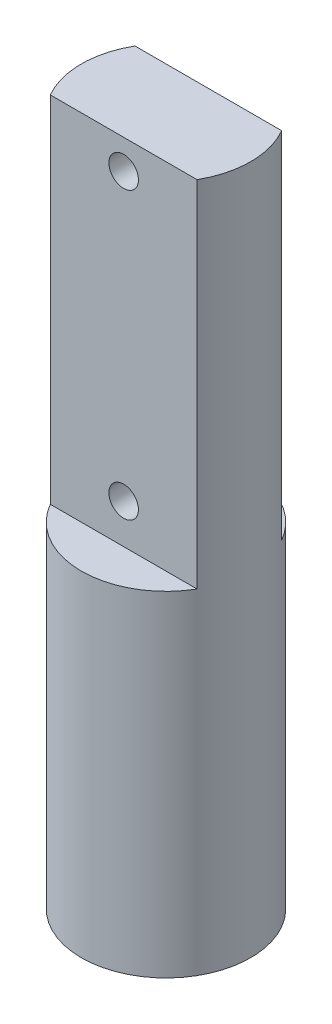
ISO-10303-21;
HEADER;
FILE_DESCRIPTION(('STEP AP214'),'2;1');
FILE_NAME('part.step','',(''),(''),'','','');
FILE_SCHEMA(('AUTOMOTIVE_DESIGN { 1 0 10303 214 1 1 1 1 }'));
ENDSEC;
DATA;
#1=APPLICATION_CONTEXT('core data for automotive mechanical design processes');
#2=APPLICATION_PROTOCOL_DEFINITION('international standard','automotive_design',2000,#1);
#3=PRODUCT_CONTEXT('',#1,'mechanical');
#4=PRODUCT('Part','Part','',(#3));
#5=PRODUCT_RELATED_PRODUCT_CATEGORY('part','',(#4));
#6=PRODUCT_DEFINITION_FORMATION('','',#4);
#7=PRODUCT_DEFINITION_CONTEXT('part definition',#1,'design');
#8=PRODUCT_DEFINITION('design','',#6,#7);
#9=PRODUCT_DEFINITION_SHAPE('','',#8);
#10=(LENGTH_UNIT() NAMED_UNIT(*) SI_UNIT(.MILLI.,.METRE.));
#11=(NAMED_UNIT(*) PLANE_ANGLE_UNIT() SI_UNIT($,.RADIAN.));
#12=(NAMED_UNIT(*) SI_UNIT($,.STERADIAN.) SOLID_ANGLE_UNIT());
#13=UNCERTAINTY_MEASURE_WITH_UNIT(LENGTH_MEASURE(1.E-05),#10,'distance_accuracy_value','');
#14=(GEOMETRIC_REPRESENTATION_CONTEXT(3) GLOBAL_UNCERTAINTY_ASSIGNED_CONTEXT((#13)) GLOBAL_UNIT_ASSIGNED_CONTEXT((#10,
#11,#12)) REPRESENTATION_CONTEXT('',''));
#15=CARTESIAN_POINT('',(0.,0.,0.));
#16=DIRECTION('',(0.,0.,1.));
#17=DIRECTION('',(1.,0.,0.));
#18=AXIS2_PLACEMENT_3D('',#15,#16,#17);
#19=CARTESIAN_POINT('',(0.,35.,0.));
#20=DIRECTION('',(0.,-1.,0.));
#21=DIRECTION('',(0.,0.,-1.));
#22=AXIS2_PLACEMENT_3D('',#19,#20,#21);
#23=CYLINDRICAL_SURFACE('',#22,4.3);
#24=CARTESIAN_POINT('',(-4.3,0.25,0.));
#25=CARTESIAN_POINT('',(-4.29999926638972,0.250001648928864,-0.0417880508407482));
#26=CARTESIAN_POINT('',(-4.2993845208085,0.253504282248725,-0.0835981818989071));
#27=CARTESIAN_POINT('',(-4.29699139488289,0.267415300580521,-0.166043809446362));
#28=CARTESIAN_POINT('',(-4.2952119760692,0.277829848648529,-0.206678223824261));
#29=CARTESIAN_POINT('',(-4.29068889751024,0.305239026463114,-0.285567841982349));
#30=CARTESIAN_POINT('',(-4.28794605633779,0.322228071424315,-0.323825033197758));
#31=CARTESIAN_POINT('',(-4.2817969720203,0.362288909924635,-0.396941522328641));
#32=CARTESIAN_POINT('',(-4.27839079673796,0.385360081314374,-0.431801167284692));
#33=CARTESIAN_POINT('',(-4.27125233222738,0.437186031595139,-0.497500986438229));
#34=CARTESIAN_POINT('',(-4.2675172948537,0.465991870364442,-0.528300588792169));
#35=CARTESIAN_POINT('',(-4.26016287101436,0.528359577761016,-0.584655380746544));
#36=CARTESIAN_POINT('',(-4.25654349221094,0.561921760693548,-0.610210223493173));
#37=CARTESIAN_POINT('',(-4.24980354586789,0.633131060922035,-0.655514911708166));
#38=CARTESIAN_POINT('',(-4.24668652699381,0.670804333579496,-0.67522422067108));
#39=CARTESIAN_POINT('',(-4.24134257686722,0.748990473640167,-0.708019045830521));
#40=CARTESIAN_POINT('',(-4.23911557958536,0.789503130131604,-0.721105053418914));
#41=CARTESIAN_POINT('',(-4.23583129642163,0.871786457694657,-0.740153116513572));
#42=CARTESIAN_POINT('',(-4.2347624743742,0.913540383710471,-0.746185479552076));
#43=CARTESIAN_POINT('',(-4.23388070551353,0.997480387393108,-0.751173093691664));
#44=CARTESIAN_POINT('',(-4.23406766135466,1.03966643130981,-0.750128893355033));
#45=CARTESIAN_POINT('',(-4.23566580216719,1.12276860803946,-0.74105019665266));
#46=CARTESIAN_POINT('',(-4.23706309423948,1.16369371315601,-0.733095025155751));
#47=CARTESIAN_POINT('',(-4.24090269461358,1.24361932870381,-0.710544848893874));
#48=CARTESIAN_POINT('',(-4.24334504185311,1.28261976736349,-0.695949596724768));
#49=CARTESIAN_POINT('',(-4.2490143958248,1.35782451258538,-0.660454167933393));
#50=CARTESIAN_POINT('',(-4.25224544405839,1.39401310944759,-0.639521379003615));
#51=CARTESIAN_POINT('',(-4.25912538619726,1.46239415898011,-0.591968203023326));
#52=CARTESIAN_POINT('',(-4.26277431694257,1.49458625880174,-0.565347314337231));
#53=CARTESIAN_POINT('',(-4.27013974606156,1.55451936881401,-0.506743025804354));
#54=CARTESIAN_POINT('',(-4.27385648859078,1.58219391382337,-0.474691640408195));
#55=CARTESIAN_POINT('',(-4.28089299866022,1.63178252295475,-0.4063652311659));
#56=CARTESIAN_POINT('',(-4.28421276317013,1.65369654310555,-0.370090175082709));
#57=CARTESIAN_POINT('',(-4.29008666470831,1.69114942661306,-0.294281196215158));
#58=CARTESIAN_POINT('',(-4.29264005113561,1.70668204539395,-0.254744126562682));
#59=CARTESIAN_POINT('',(-4.29668756322354,1.73086755941298,-0.173567831932192));
#60=CARTESIAN_POINT('',(-4.29818178604495,1.73952108570317,-0.131928800149992));
#61=CARTESIAN_POINT('',(-4.29992944696258,1.7496118073207,-0.0483030504041));
#62=CARTESIAN_POINT('',(-4.3001985614524,1.75114018168856,-0.00632765104635834));
#63=CARTESIAN_POINT('',(-4.29950875179802,1.74718083650912,0.0772792291684754));
#64=CARTESIAN_POINT('',(-4.29854987957069,1.74169341357592,0.11891072449026));
#65=CARTESIAN_POINT('',(-4.29552156034356,1.72393407350918,0.200363676970759));
#66=CARTESIAN_POINT('',(-4.29345956389819,1.71170765528832,0.240195355348366));
#67=CARTESIAN_POINT('',(-4.28845524658441,1.68086615385983,0.31724359746027));
#68=CARTESIAN_POINT('',(-4.28551287244903,1.66225068407471,0.354460002790035));
#69=CARTESIAN_POINT('',(-4.27903518267186,1.61895320290467,0.425614839024295));
#70=CARTESIAN_POINT('',(-4.27549444710934,1.59421468054526,0.459518380058128));
#71=CARTESIAN_POINT('',(-4.26822821844665,1.53945060738056,0.522725487316165));
#72=CARTESIAN_POINT('',(-4.26450271058035,1.50942463353665,0.552028685120829));
#73=CARTESIAN_POINT('',(-4.25723565824332,1.44452762498483,0.60554434083323));
#74=CARTESIAN_POINT('',(-4.25369669469759,1.40960526532975,0.62969496515801));
#75=CARTESIAN_POINT('',(-4.24725293297475,1.33614574580622,0.671787047550439));
#76=CARTESIAN_POINT('',(-4.24434811335954,1.29760870819983,0.689728715532231));
#77=CARTESIAN_POINT('',(-4.23952122215334,1.21818092720123,0.71880282079533));
#78=CARTESIAN_POINT('',(-4.23759484131931,1.17730140271792,0.729965158951758));
#79=CARTESIAN_POINT('',(-4.23493246488616,1.0942109356068,0.745257214187159));
#80=CARTESIAN_POINT('',(-4.23419635490076,1.05200012131488,0.749387607045549));
#81=CARTESIAN_POINT('',(-4.23400311265296,0.968063389187448,0.750478315138877));
#82=CARTESIAN_POINT('',(-4.23452860691097,0.926338745295987,0.747536027155071));
#83=CARTESIAN_POINT('',(-4.23676112646517,0.843988132513841,0.734776442246822));
#84=CARTESIAN_POINT('',(-4.23846814684283,0.803362159050271,0.724959173942));
#85=CARTESIAN_POINT('',(-4.24286451900407,0.724405073036289,0.698766999037293));
#86=CARTESIAN_POINT('',(-4.2455524973939,0.686070838833909,0.682401257576454));
#87=CARTESIAN_POINT('',(-4.2516091088947,0.612676452519474,0.643586916823754));
#88=CARTESIAN_POINT('',(-4.25497778098402,0.577616488069058,0.621137969166094));
#89=CARTESIAN_POINT('',(-4.26207088679326,0.511275265173909,0.570450068884655));
#90=CARTESIAN_POINT('',(-4.26579937145496,0.48004897367634,0.542139730404381));
#91=CARTESIAN_POINT('',(-4.27316041880179,0.42275719633857,0.480682687943183));
#92=CARTESIAN_POINT('',(-4.27679295920461,0.396692900355416,0.447534871958872));
#93=CARTESIAN_POINT('',(-4.28358514702488,0.350281411357932,0.377041827580638));
#94=CARTESIAN_POINT('',(-4.28674096989397,0.329979413928963,0.339666468462769));
#95=CARTESIAN_POINT('',(-4.29218692806471,0.295974054354022,0.261994677005647));
#96=CARTESIAN_POINT('',(-4.29447790760072,0.282264253503343,0.221701139351332));
#97=CARTESIAN_POINT('',(-4.29744780863532,0.264739781276116,0.151053464857476));
#98=CARTESIAN_POINT('',(-4.29839966207502,0.259221425489235,0.121121834423538));
#99=CARTESIAN_POINT('',(-4.29967601838447,0.25185097154175,0.0607973595026825));
#100=CARTESIAN_POINT('',(-4.30000053376673,0.249998800257571,0.0304045242268715));
#101=CARTESIAN_POINT('',(-4.3,0.25,0.));
#102=B_SPLINE_CURVE_WITH_KNOTS('',3,(#24,#25,#26,#27,#28,#29,#30,#31,#32,#33,#34,#35,#36,#37,
#38,#39,#40,#41,#42,#43,#44,#45,#46,#47,#48,#49,#50,#51,#52,#53,#54,#55,#56,#57,#58,#59,#60,#61,
#62,#63,#64,#65,#66,#67,#68,#69,#70,#71,#72,#73,#74,#75,#76,#77,#78,#79,#80,#81,#82,#83,#84,#85,
#86,#87,#88,#89,#90,#91,#92,#93,#94,#95,#96,#97,#98,#99,#100,#101),.UNSPECIFIED.,.T.,.F.,(4,2,2,
2,2,2,2,2,2,2,2,2,2,2,2,2,2,2,2,2,2,2,2,2,2,2,2,2,2,2,2,2,2,2,2,2,2,2,4),(0.,0.125252996199785,
0.250617825406938,0.375876394889566,0.50112215646291,0.627537418061207,0.753961037239065,
0.881241888884177,1.00851329600257,1.13450500342474,1.26048694431127,1.38504167555774,
1.5096010479948,1.63481261051328,1.76003522004597,1.88696029547256,2.01388633971493,
2.14093629439122,2.26797459282222,2.39338266364192,2.51878543263069,2.64335172479294,
2.76792555532226,2.89369502791514,3.01947456765252,3.14668779548681,3.27389672204023,
3.40054042803455,3.52717196271096,3.65206968700409,3.77696689136787,3.90168989961903,
4.02642005186868,4.15276953204653,4.27914810238747,4.40649211316999,4.53371149107416,
4.62484600537639,4.71597870194454),.UNSPECIFIED.);
#103=CARTESIAN_POINT('',(-4.3,0.25,0.));
#104=VERTEX_POINT('',#103);
#105=EDGE_CURVE('E11',#104,#104,#102,.T.);
#106=ORIENTED_EDGE('',*,*,#105,.T.);
#107=EDGE_LOOP('',(#106));
#108=FACE_BOUND('',#107,.T.);
#109=CARTESIAN_POINT('',(0.,35.,0.));
#110=DIRECTION('',(0.,1.,0.));
#111=DIRECTION('',(0.,0.,1.));
#112=AXIS2_PLACEMENT_3D('',#109,#110,#111);
#113=CIRCLE('',#112,4.3);
#114=CARTESIAN_POINT('',(3.72390923627309,35.,2.15));
#115=VERTEX_POINT('',#114);
#116=CARTESIAN_POINT('',(3.72390923627308,35.,-2.15));
#117=VERTEX_POINT('',#116);
#118=EDGE_CURVE('E112',#115,#117,#113,.T.);
#119=ORIENTED_EDGE('',*,*,#118,.F.);
#120=DIRECTION('',(0.,1.,0.));
#121=VECTOR('',#120,1.);
#122=CARTESIAN_POINT('',(3.72390923627308,17.,2.15));
#123=LINE('',#122,#121);
#124=CARTESIAN_POINT('',(3.72390923627308,17.,2.15));
#125=VERTEX_POINT('',#124);
#126=EDGE_CURVE('E51',#125,#115,#123,.T.);
#127=ORIENTED_EDGE('',*,*,#126,.F.);
#128=CARTESIAN_POINT('',(0.,17.,0.));
#129=DIRECTION('',(0.,1.,0.));
#130=DIRECTION('',(0.,0.,1.));
#131=AXIS2_PLACEMENT_3D('',#128,#129,#130);
#132=CIRCLE('',#131,4.3);
#133=CARTESIAN_POINT('',(-3.72390923627308,17.,2.15));
#134=VERTEX_POINT('',#133);
#135=EDGE_CURVE('E81',#134,#125,#132,.T.);
#136=ORIENTED_EDGE('',*,*,#135,.F.);
#137=DIRECTION('',(0.,1.,0.));
#138=VECTOR('',#137,1.);
#139=CARTESIAN_POINT('',(-3.72390923627308,17.,2.15));
#140=LINE('',#139,#138);
#141=CARTESIAN_POINT('',(-3.72390923627308,35.,2.15));
#142=VERTEX_POINT('',#141);
#143=EDGE_CURVE('E85',#134,#142,#140,.T.);
#144=ORIENTED_EDGE('',*,*,#143,.T.);
#145=CARTESIAN_POINT('',(-3.72390923627309,35.,-2.15));
#146=VERTEX_POINT('',#145);
#147=EDGE_CURVE('E44',#146,#142,#113,.T.);
#148=ORIENTED_EDGE('',*,*,#147,.F.);
#149=DIRECTION('',(0.,1.,0.));
#150=VECTOR('',#149,1.);
#151=CARTESIAN_POINT('',(-3.72390923627308,17.,-2.15));
#152=LINE('',#151,#150);
#153=CARTESIAN_POINT('',(-3.72390923627308,17.,-2.15));
#154=VERTEX_POINT('',#153);
#155=EDGE_CURVE('E59',#154,#146,#152,.T.);
#156=ORIENTED_EDGE('',*,*,#155,.F.);
#157=CARTESIAN_POINT('',(0.,17.,0.));
#158=DIRECTION('',(0.,1.,0.));
#159=DIRECTION('',(0.,0.,-1.));
#160=AXIS2_PLACEMENT_3D('',#157,#158,#159);
#161=CIRCLE('',#160,4.3);
#162=CARTESIAN_POINT('',(3.72390923627308,17.,-2.15));
#163=VERTEX_POINT('',#162);
#164=EDGE_CURVE('E103',#163,#154,#161,.T.);
#165=ORIENTED_EDGE('',*,*,#164,.F.);
#166=DIRECTION('',(0.,1.,0.));
#167=VECTOR('',#166,1.);
#168=CARTESIAN_POINT('',(3.72390923627308,17.,-2.15));
#169=LINE('',#168,#167);
#170=EDGE_CURVE('E106',#163,#117,#169,.T.);
#171=ORIENTED_EDGE('',*,*,#170,.T.);
#172=EDGE_LOOP('',(#119,#127,#136,#144,#148,#156,#165,#171));
#173=FACE_BOUND('',#172,.T.);
#174=CARTESIAN_POINT('',(0.,0.,0.));
#175=DIRECTION('',(0.,1.,0.));
#176=DIRECTION('',(0.,0.,1.));
#177=AXIS2_PLACEMENT_3D('',#174,#175,#176);
#178=CIRCLE('',#177,4.3);
#179=CARTESIAN_POINT('',(0.,0.,4.3));
#180=VERTEX_POINT('',#179);
#181=EDGE_CURVE('E109',#180,#180,#178,.T.);
#182=ORIENTED_EDGE('',*,*,#181,.T.);
#183=EDGE_LOOP('',(#182));
#184=FACE_BOUND('',#183,.T.);
#185=ADVANCED_FACE('F33',(#108,#173,#184),#23,.T.);
#186=CARTESIAN_POINT('',(0.,35.,0.));
#187=DIRECTION('',(0.,1.,0.));
#188=DIRECTION('',(0.,0.,1.));
#189=AXIS2_PLACEMENT_3D('',#186,#187,#188);
#190=PLANE('',#189);
#191=DIRECTION('',(-1.,0.,0.));
#192=VECTOR('',#191,1.);
#193=CARTESIAN_POINT('',(0.,35.,2.15));
#194=LINE('',#193,#192);
#195=EDGE_CURVE('E82',#115,#142,#194,.T.);
#196=ORIENTED_EDGE('',*,*,#195,.F.);
#197=ORIENTED_EDGE('',*,*,#118,.T.);
#198=DIRECTION('',(1.,0.,0.));
#199=VECTOR('',#198,1.);
#200=CARTESIAN_POINT('',(0.,35.,-2.15));
#201=LINE('',#200,#199);
#202=EDGE_CURVE('E98',#146,#117,#201,.T.);
#203=ORIENTED_EDGE('',*,*,#202,.F.);
#204=ORIENTED_EDGE('',*,*,#147,.T.);
#205=EDGE_LOOP('',(#196,#197,#203,#204));
#206=FACE_BOUND('',#205,.T.);
#207=ADVANCED_FACE('F116',(#206),#190,.T.);
#208=CARTESIAN_POINT('',(0.,0.,0.));
#209=DIRECTION('',(0.,1.,0.));
#210=DIRECTION('',(0.,0.,1.));
#211=AXIS2_PLACEMENT_3D('',#208,#209,#210);
#212=PLANE('',#211);
#213=ORIENTED_EDGE('',*,*,#181,.F.);
#214=EDGE_LOOP('',(#213));
#215=FACE_BOUND('',#214,.T.);
#216=ADVANCED_FACE('F129',(#215),#212,.F.);
#217=CARTESIAN_POINT('',(0.,17.,-2.15));
#218=DIRECTION('',(0.,0.,1.));
#219=DIRECTION('',(1.,0.,0.));
#220=AXIS2_PLACEMENT_3D('',#217,#218,#219);
#221=PLANE('',#220);
#222=CARTESIAN_POINT('',(0.,33.5,-2.15));
#223=DIRECTION('',(0.,0.,1.));
#224=DIRECTION('',(1.,0.,0.));
#225=AXIS2_PLACEMENT_3D('',#222,#223,#224);
#226=CIRCLE('',#225,0.750000000000001);
#227=CARTESIAN_POINT('',(0.75,33.5,-2.15));
#228=VERTEX_POINT('',#227);
#229=EDGE_CURVE('E214',#228,#228,#226,.T.);
#230=ORIENTED_EDGE('',*,*,#229,.T.);
#231=EDGE_LOOP('',(#230));
#232=FACE_BOUND('',#231,.T.);
#233=CARTESIAN_POINT('',(0.,19.,-2.15));
#234=DIRECTION('',(0.,0.,1.));
#235=DIRECTION('',(1.,0.,0.));
#236=AXIS2_PLACEMENT_3D('',#233,#234,#235);
#237=CIRCLE('',#236,0.750000000000001);
#238=CARTESIAN_POINT('',(0.75,19.,-2.15));
#239=VERTEX_POINT('',#238);
#240=EDGE_CURVE('E97',#239,#239,#237,.T.);
#241=ORIENTED_EDGE('',*,*,#240,.T.);
#242=EDGE_LOOP('',(#241));
#243=FACE_BOUND('',#242,.T.);
#244=ORIENTED_EDGE('',*,*,#202,.T.);
#245=ORIENTED_EDGE('',*,*,#170,.F.);
#246=DIRECTION('',(1.,0.,0.));
#247=VECTOR('',#246,1.);
#248=CARTESIAN_POINT('',(0.,17.,-2.15));
#249=LINE('',#248,#247);
#250=EDGE_CURVE('E100',#154,#163,#249,.T.);
#251=ORIENTED_EDGE('',*,*,#250,.F.);
#252=ORIENTED_EDGE('',*,*,#155,.T.);
#253=EDGE_LOOP('',(#244,#245,#251,#252));
#254=FACE_BOUND('',#253,.T.);
#255=ADVANCED_FACE('F117',(#232,#243,#254),#221,.F.);
#256=CARTESIAN_POINT('',(0.,17.,0.));
#257=DIRECTION('',(0.,-1.,0.));
#258=DIRECTION('',(0.,0.,-1.));
#259=AXIS2_PLACEMENT_3D('',#256,#257,#258);
#260=PLANE('',#259);
#261=ORIENTED_EDGE('',*,*,#250,.T.);
#262=ORIENTED_EDGE('',*,*,#164,.T.);
#263=EDGE_LOOP('',(#261,#262));
#264=FACE_BOUND('',#263,.T.);
#265=ADVANCED_FACE('F120',(#264),#260,.F.);
#266=CARTESIAN_POINT('',(0.,17.,2.15));
#267=DIRECTION('',(0.,0.,-1.));
#268=DIRECTION('',(-1.,0.,0.));
#269=AXIS2_PLACEMENT_3D('',#266,#267,#268);
#270=PLANE('',#269);
#271=CARTESIAN_POINT('',(0.,33.5,2.15));
#272=DIRECTION('',(0.,0.,1.));
#273=DIRECTION('',(1.,0.,0.));
#274=AXIS2_PLACEMENT_3D('',#271,#272,#273);
#275=CIRCLE('',#274,0.750000000000001);
#276=CARTESIAN_POINT('',(0.75,33.5,2.15));
#277=VERTEX_POINT('',#276);
#278=EDGE_CURVE('E211',#277,#277,#275,.T.);
#279=ORIENTED_EDGE('',*,*,#278,.F.);
#280=EDGE_LOOP('',(#279));
#281=FACE_BOUND('',#280,.T.);
#282=CARTESIAN_POINT('',(0.,19.,2.15));
#283=DIRECTION('',(0.,0.,1.));
#284=DIRECTION('',(1.,0.,0.));
#285=AXIS2_PLACEMENT_3D('',#282,#283,#284);
#286=CIRCLE('',#285,0.750000000000001);
#287=CARTESIAN_POINT('',(0.75,19.,2.15));
#288=VERTEX_POINT('',#287);
#289=EDGE_CURVE('E217',#288,#288,#286,.T.);
#290=ORIENTED_EDGE('',*,*,#289,.F.);
#291=EDGE_LOOP('',(#290));
#292=FACE_BOUND('',#291,.T.);
#293=ORIENTED_EDGE('',*,*,#195,.T.);
#294=ORIENTED_EDGE('',*,*,#143,.F.);
#295=DIRECTION('',(-1.,0.,0.));
#296=VECTOR('',#295,1.);
#297=CARTESIAN_POINT('',(0.,17.,2.15));
#298=LINE('',#297,#296);
#299=EDGE_CURVE('E77',#125,#134,#298,.T.);
#300=ORIENTED_EDGE('',*,*,#299,.F.);
#301=ORIENTED_EDGE('',*,*,#126,.T.);
#302=EDGE_LOOP('',(#293,#294,#300,#301));
#303=FACE_BOUND('',#302,.T.);
#304=ADVANCED_FACE('F86',(#281,#292,#303),#270,.F.);
#305=CARTESIAN_POINT('',(0.,17.,0.));
#306=DIRECTION('',(0.,1.,0.));
#307=DIRECTION('',(0.,0.,1.));
#308=AXIS2_PLACEMENT_3D('',#305,#306,#307);
#309=PLANE('',#308);
#310=ORIENTED_EDGE('',*,*,#299,.T.);
#311=ORIENTED_EDGE('',*,*,#135,.T.);
#312=EDGE_LOOP('',(#310,#311));
#313=FACE_BOUND('',#312,.T.);
#314=ADVANCED_FACE('F79',(#313),#309,.T.);
#315=CARTESIAN_POINT('',(0.,19.,-7.85));
#316=DIRECTION('',(0.,0.,1.));
#317=DIRECTION('',(1.,0.,0.));
#318=AXIS2_PLACEMENT_3D('',#315,#316,#317);
#319=CYLINDRICAL_SURFACE('',#318,0.750000000000001);
#320=ORIENTED_EDGE('',*,*,#289,.T.);
#321=EDGE_LOOP('',(#320));
#322=FACE_BOUND('',#321,.T.);
#323=ORIENTED_EDGE('',*,*,#240,.F.);
#324=EDGE_LOOP('',(#323));
#325=FACE_BOUND('',#324,.T.);
#326=ADVANCED_FACE('F143',(#322,#325),#319,.F.);
#327=CARTESIAN_POINT('',(-4.3,1.,0.));
#328=DIRECTION('',(1.,0.,0.));
#329=DIRECTION('',(0.,0.,-1.));
#330=AXIS2_PLACEMENT_3D('',#327,#328,#329);
#331=CYLINDRICAL_SURFACE('',#330,0.75);
#332=CARTESIAN_POINT('',(0.,1.,0.));
#333=DIRECTION('',(1.,0.,0.));
#334=DIRECTION('',(0.,0.,-1.));
#335=AXIS2_PLACEMENT_3D('',#332,#333,#334);
#336=CIRCLE('',#335,0.75);
#337=CARTESIAN_POINT('',(0.,1.,-0.75));
#338=VERTEX_POINT('',#337);
#339=EDGE_CURVE('E215',#338,#338,#336,.T.);
#340=ORIENTED_EDGE('',*,*,#339,.T.);
#341=EDGE_LOOP('',(#340));
#342=FACE_BOUND('',#341,.T.);
#343=ORIENTED_EDGE('',*,*,#105,.F.);
#344=EDGE_LOOP('',(#343));
#345=FACE_BOUND('',#344,.T.);
#346=ADVANCED_FACE('F140',(#342,#345),#331,.F.);
#347=CARTESIAN_POINT('',(0.,1.,0.));
#348=DIRECTION('',(1.,0.,0.));
#349=DIRECTION('',(0.,0.,-1.));
#350=AXIS2_PLACEMENT_3D('',#347,#348,#349);
#351=PLANE('',#350);
#352=ORIENTED_EDGE('',*,*,#339,.F.);
#353=EDGE_LOOP('',(#352));
#354=FACE_BOUND('',#353,.T.);
#355=ADVANCED_FACE('F142',(#354),#351,.F.);
#356=CARTESIAN_POINT('',(0.,33.5,-7.85));
#357=DIRECTION('',(0.,0.,1.));
#358=DIRECTION('',(1.,0.,0.));
#359=AXIS2_PLACEMENT_3D('',#356,#357,#358);
#360=CYLINDRICAL_SURFACE('',#359,0.750000000000001);
#361=ORIENTED_EDGE('',*,*,#278,.T.);
#362=EDGE_LOOP('',(#361));
#363=FACE_BOUND('',#362,.T.);
#364=ORIENTED_EDGE('',*,*,#229,.F.);
#365=EDGE_LOOP('',(#364));
#366=FACE_BOUND('',#365,.T.);
#367=ADVANCED_FACE('F149',(#363,#366),#360,.F.);
#368=CLOSED_SHELL('',(#185,#207,#216,#255,#265,#304,#314,#326,#346,#355,#367));
#369=MANIFOLD_SOLID_BREP('B2',#368);
#370=ADVANCED_BREP_SHAPE_REPRESENTATION('',(#18,#369),#14);
#371=SHAPE_DEFINITION_REPRESENTATION(#9,#370);
ENDSEC;
END-ISO-10303-21;
